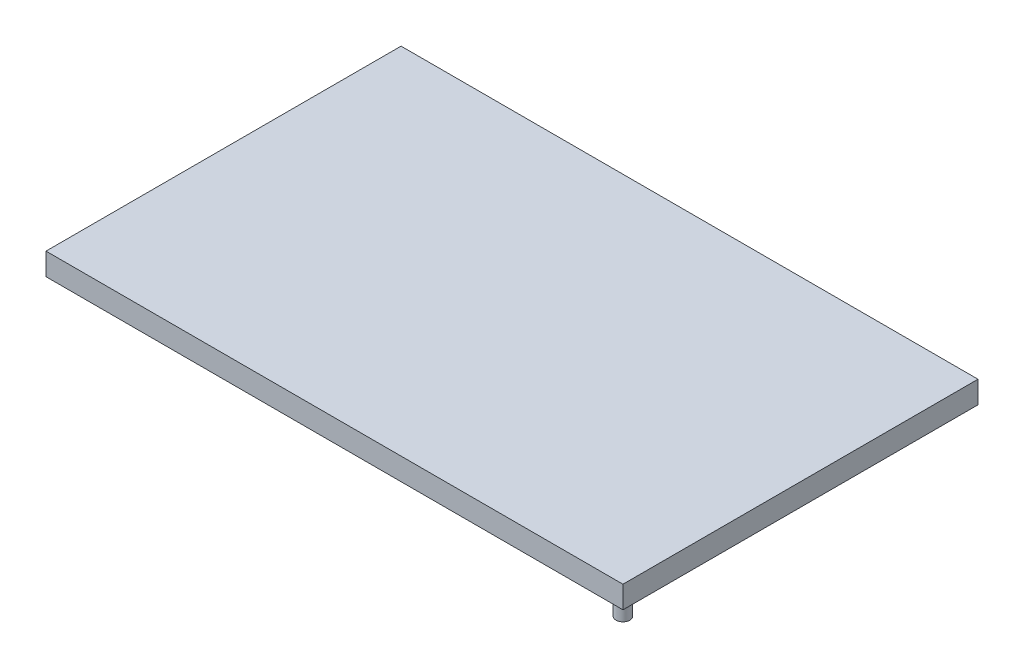
ISO-10303-21;
HEADER;
FILE_DESCRIPTION(('STEP AP214'),'2;1');
FILE_NAME('part.step','',(''),(''),'','','');
FILE_SCHEMA(('AUTOMOTIVE_DESIGN { 1 0 10303 214 1 1 1 1 }'));
ENDSEC;
DATA;
#1=APPLICATION_CONTEXT('core data for automotive mechanical design processes');
#2=APPLICATION_PROTOCOL_DEFINITION('international standard','automotive_design',2000,#1);
#3=PRODUCT_CONTEXT('',#1,'mechanical');
#4=PRODUCT('Part','Part','',(#3));
#5=PRODUCT_RELATED_PRODUCT_CATEGORY('part','',(#4));
#6=PRODUCT_DEFINITION_FORMATION('','',#4);
#7=PRODUCT_DEFINITION_CONTEXT('part definition',#1,'design');
#8=PRODUCT_DEFINITION('design','',#6,#7);
#9=PRODUCT_DEFINITION_SHAPE('','',#8);
#10=(LENGTH_UNIT() NAMED_UNIT(*) SI_UNIT(.MILLI.,.METRE.));
#11=(NAMED_UNIT(*) PLANE_ANGLE_UNIT() SI_UNIT($,.RADIAN.));
#12=(NAMED_UNIT(*) SI_UNIT($,.STERADIAN.) SOLID_ANGLE_UNIT());
#13=UNCERTAINTY_MEASURE_WITH_UNIT(LENGTH_MEASURE(1.E-05),#10,'distance_accuracy_value','');
#14=(GEOMETRIC_REPRESENTATION_CONTEXT(3) GLOBAL_UNCERTAINTY_ASSIGNED_CONTEXT((#13)) GLOBAL_UNIT_ASSIGNED_CONTEXT((#10,
#11,#12)) REPRESENTATION_CONTEXT('',''));
#15=CARTESIAN_POINT('',(0.,0.,0.));
#16=DIRECTION('',(0.,0.,1.));
#17=DIRECTION('',(1.,0.,0.));
#18=AXIS2_PLACEMENT_3D('',#15,#16,#17);
#19=CARTESIAN_POINT('',(-104.,8.,-64.));
#20=DIRECTION('',(0.,0.,-1.));
#21=DIRECTION('',(-1.,0.,0.));
#22=AXIS2_PLACEMENT_3D('',#19,#20,#21);
#23=PLANE('',#22);
#24=DIRECTION('',(1.,0.,0.));
#25=VECTOR('',#24,1.);
#26=CARTESIAN_POINT('',(-104.,0.,-64.));
#27=LINE('',#26,#25);
#28=CARTESIAN_POINT('',(-104.,0.,-64.));
#29=VERTEX_POINT('',#28);
#30=CARTESIAN_POINT('',(104.,0.,-64.));
#31=VERTEX_POINT('',#30);
#32=EDGE_CURVE('E113',#29,#31,#27,.T.);
#33=ORIENTED_EDGE('',*,*,#32,.F.);
#34=DIRECTION('',(0.,-1.,0.));
#35=VECTOR('',#34,1.);
#36=CARTESIAN_POINT('',(-104.,8.,-64.));
#37=LINE('',#36,#35);
#38=CARTESIAN_POINT('',(-104.,8.,-64.));
#39=VERTEX_POINT('',#38);
#40=EDGE_CURVE('E56',#39,#29,#37,.T.);
#41=ORIENTED_EDGE('',*,*,#40,.F.);
#42=DIRECTION('',(1.,0.,0.));
#43=VECTOR('',#42,1.);
#44=CARTESIAN_POINT('',(-104.,8.,-64.));
#45=LINE('',#44,#43);
#46=CARTESIAN_POINT('',(104.,8.,-64.));
#47=VERTEX_POINT('',#46);
#48=EDGE_CURVE('E145',#39,#47,#45,.T.);
#49=ORIENTED_EDGE('',*,*,#48,.T.);
#50=DIRECTION('',(0.,-1.,0.));
#51=VECTOR('',#50,1.);
#52=CARTESIAN_POINT('',(104.,8.,-64.));
#53=LINE('',#52,#51);
#54=EDGE_CURVE('E81',#47,#31,#53,.T.);
#55=ORIENTED_EDGE('',*,*,#54,.T.);
#56=EDGE_LOOP('',(#33,#41,#49,#55));
#57=FACE_BOUND('',#56,.T.);
#58=ADVANCED_FACE('F33',(#57),#23,.T.);
#59=CARTESIAN_POINT('',(-104.,8.,-64.));
#60=DIRECTION('',(1.,0.,0.));
#61=DIRECTION('',(0.,0.,-1.));
#62=AXIS2_PLACEMENT_3D('',#59,#60,#61);
#63=PLANE('',#62);
#64=DIRECTION('',(0.,0.,1.));
#65=VECTOR('',#64,1.);
#66=CARTESIAN_POINT('',(-104.,0.,-64.));
#67=LINE('',#66,#65);
#68=CARTESIAN_POINT('',(-104.,0.,64.));
#69=VERTEX_POINT('',#68);
#70=EDGE_CURVE('E148',#29,#69,#67,.T.);
#71=ORIENTED_EDGE('',*,*,#70,.T.);
#72=DIRECTION('',(0.,-1.,0.));
#73=VECTOR('',#72,1.);
#74=CARTESIAN_POINT('',(-104.,8.,64.));
#75=LINE('',#74,#73);
#76=CARTESIAN_POINT('',(-104.,8.,64.));
#77=VERTEX_POINT('',#76);
#78=EDGE_CURVE('E164',#77,#69,#75,.T.);
#79=ORIENTED_EDGE('',*,*,#78,.F.);
#80=DIRECTION('',(0.,0.,1.));
#81=VECTOR('',#80,1.);
#82=CARTESIAN_POINT('',(-104.,8.,-64.));
#83=LINE('',#82,#81);
#84=EDGE_CURVE('E152',#39,#77,#83,.T.);
#85=ORIENTED_EDGE('',*,*,#84,.F.);
#86=ORIENTED_EDGE('',*,*,#40,.T.);
#87=EDGE_LOOP('',(#71,#79,#85,#86));
#88=FACE_BOUND('',#87,.T.);
#89=ADVANCED_FACE('F192',(#88),#63,.F.);
#90=CARTESIAN_POINT('',(-104.,8.,64.));
#91=DIRECTION('',(0.,0.,-1.));
#92=DIRECTION('',(-1.,0.,0.));
#93=AXIS2_PLACEMENT_3D('',#90,#91,#92);
#94=PLANE('',#93);
#95=DIRECTION('',(1.,0.,0.));
#96=VECTOR('',#95,1.);
#97=CARTESIAN_POINT('',(-104.,0.,64.));
#98=LINE('',#97,#96);
#99=CARTESIAN_POINT('',(104.,0.,64.));
#100=VERTEX_POINT('',#99);
#101=EDGE_CURVE('E159',#69,#100,#98,.T.);
#102=ORIENTED_EDGE('',*,*,#101,.T.);
#103=DIRECTION('',(0.,-1.,0.));
#104=VECTOR('',#103,1.);
#105=CARTESIAN_POINT('',(104.,8.,64.));
#106=LINE('',#105,#104);
#107=CARTESIAN_POINT('',(104.,8.,64.));
#108=VERTEX_POINT('',#107);
#109=EDGE_CURVE('E167',#108,#100,#106,.T.);
#110=ORIENTED_EDGE('',*,*,#109,.F.);
#111=DIRECTION('',(1.,0.,0.));
#112=VECTOR('',#111,1.);
#113=CARTESIAN_POINT('',(-104.,8.,64.));
#114=LINE('',#113,#112);
#115=EDGE_CURVE('E150',#77,#108,#114,.T.);
#116=ORIENTED_EDGE('',*,*,#115,.F.);
#117=ORIENTED_EDGE('',*,*,#78,.T.);
#118=EDGE_LOOP('',(#102,#110,#116,#117));
#119=FACE_BOUND('',#118,.T.);
#120=ADVANCED_FACE('F196',(#119),#94,.F.);
#121=CARTESIAN_POINT('',(104.,8.,-64.));
#122=DIRECTION('',(1.,0.,0.));
#123=DIRECTION('',(0.,0.,-1.));
#124=AXIS2_PLACEMENT_3D('',#121,#122,#123);
#125=PLANE('',#124);
#126=DIRECTION('',(0.,0.,1.));
#127=VECTOR('',#126,1.);
#128=CARTESIAN_POINT('',(104.,0.,-64.));
#129=LINE('',#128,#127);
#130=EDGE_CURVE('E156',#31,#100,#129,.T.);
#131=ORIENTED_EDGE('',*,*,#130,.F.);
#132=ORIENTED_EDGE('',*,*,#54,.F.);
#133=DIRECTION('',(0.,0.,1.));
#134=VECTOR('',#133,1.);
#135=CARTESIAN_POINT('',(104.,8.,-64.));
#136=LINE('',#135,#134);
#137=EDGE_CURVE('E147',#47,#108,#136,.T.);
#138=ORIENTED_EDGE('',*,*,#137,.T.);
#139=ORIENTED_EDGE('',*,*,#109,.T.);
#140=EDGE_LOOP('',(#131,#132,#138,#139));
#141=FACE_BOUND('',#140,.T.);
#142=ADVANCED_FACE('F208',(#141),#125,.T.);
#143=CARTESIAN_POINT('',(0.,8.,0.));
#144=DIRECTION('',(0.,-1.,0.));
#145=DIRECTION('',(0.,0.,-1.));
#146=AXIS2_PLACEMENT_3D('',#143,#144,#145);
#147=PLANE('',#146);
#148=ORIENTED_EDGE('',*,*,#48,.F.);
#149=ORIENTED_EDGE('',*,*,#84,.T.);
#150=ORIENTED_EDGE('',*,*,#115,.T.);
#151=ORIENTED_EDGE('',*,*,#137,.F.);
#152=EDGE_LOOP('',(#148,#149,#150,#151));
#153=FACE_BOUND('',#152,.T.);
#154=ADVANCED_FACE('F207',(#153),#147,.F.);
#155=CARTESIAN_POINT('',(0.,0.,0.));
#156=DIRECTION('',(0.,-1.,0.));
#157=DIRECTION('',(0.,0.,-1.));
#158=AXIS2_PLACEMENT_3D('',#155,#156,#157);
#159=PLANE('',#158);
#160=DIRECTION('',(0.,0.,1.));
#161=VECTOR('',#160,1.);
#162=CARTESIAN_POINT('',(100.,0.,0.));
#163=LINE('',#162,#161);
#164=CARTESIAN_POINT('',(100.,0.,-60.));
#165=VERTEX_POINT('',#164);
#166=CARTESIAN_POINT('',(100.,0.,60.));
#167=VERTEX_POINT('',#166);
#168=EDGE_CURVE('E47',#165,#167,#163,.T.);
#169=ORIENTED_EDGE('',*,*,#168,.F.);
#170=DIRECTION('',(1.,0.,0.));
#171=VECTOR('',#170,1.);
#172=CARTESIAN_POINT('',(0.,0.,-60.));
#173=LINE('',#172,#171);
#174=CARTESIAN_POINT('',(-100.,0.,-60.));
#175=VERTEX_POINT('',#174);
#176=EDGE_CURVE('E112',#175,#165,#173,.T.);
#177=ORIENTED_EDGE('',*,*,#176,.F.);
#178=DIRECTION('',(0.,0.,1.));
#179=VECTOR('',#178,1.);
#180=CARTESIAN_POINT('',(-100.,0.,0.));
#181=LINE('',#180,#179);
#182=CARTESIAN_POINT('',(-100.,0.,60.));
#183=VERTEX_POINT('',#182);
#184=EDGE_CURVE('E136',#175,#183,#181,.T.);
#185=ORIENTED_EDGE('',*,*,#184,.T.);
#186=DIRECTION('',(1.,0.,0.));
#187=VECTOR('',#186,1.);
#188=CARTESIAN_POINT('',(0.,0.,60.));
#189=LINE('',#188,#187);
#190=EDGE_CURVE('E122',#183,#167,#189,.T.);
#191=ORIENTED_EDGE('',*,*,#190,.T.);
#192=EDGE_LOOP('',(#169,#177,#185,#191));
#193=FACE_BOUND('',#192,.T.);
#194=ORIENTED_EDGE('',*,*,#32,.T.);
#195=ORIENTED_EDGE('',*,*,#130,.T.);
#196=ORIENTED_EDGE('',*,*,#101,.F.);
#197=ORIENTED_EDGE('',*,*,#70,.F.);
#198=EDGE_LOOP('',(#194,#195,#196,#197));
#199=FACE_BOUND('',#198,.T.);
#200=ADVANCED_FACE('F199',(#193,#199),#159,.T.);
#201=CARTESIAN_POINT('',(100.,4.,0.));
#202=DIRECTION('',(1.,0.,0.));
#203=DIRECTION('',(0.,0.,-1.));
#204=AXIS2_PLACEMENT_3D('',#201,#202,#203);
#205=PLANE('',#204);
#206=ORIENTED_EDGE('',*,*,#168,.T.);
#207=DIRECTION('',(0.,-1.,0.));
#208=VECTOR('',#207,1.);
#209=CARTESIAN_POINT('',(100.,4.,60.));
#210=LINE('',#209,#208);
#211=CARTESIAN_POINT('',(100.,4.,60.));
#212=VERTEX_POINT('',#211);
#213=EDGE_CURVE('E119',#212,#167,#210,.T.);
#214=ORIENTED_EDGE('',*,*,#213,.F.);
#215=DIRECTION('',(0.,0.,1.));
#216=VECTOR('',#215,1.);
#217=CARTESIAN_POINT('',(100.,4.,0.));
#218=LINE('',#217,#216);
#219=CARTESIAN_POINT('',(100.,4.,-60.));
#220=VERTEX_POINT('',#219);
#221=EDGE_CURVE('E117',#220,#212,#218,.T.);
#222=ORIENTED_EDGE('',*,*,#221,.F.);
#223=DIRECTION('',(0.,-1.,0.));
#224=VECTOR('',#223,1.);
#225=CARTESIAN_POINT('',(100.,4.,-60.));
#226=LINE('',#225,#224);
#227=EDGE_CURVE('E106',#220,#165,#226,.T.);
#228=ORIENTED_EDGE('',*,*,#227,.T.);
#229=EDGE_LOOP('',(#206,#214,#222,#228));
#230=FACE_BOUND('',#229,.T.);
#231=ADVANCED_FACE('F118',(#230),#205,.F.);
#232=CARTESIAN_POINT('',(0.,4.,-60.));
#233=DIRECTION('',(0.,0.,-1.));
#234=DIRECTION('',(-1.,0.,0.));
#235=AXIS2_PLACEMENT_3D('',#232,#233,#234);
#236=PLANE('',#235);
#237=ORIENTED_EDGE('',*,*,#176,.T.);
#238=ORIENTED_EDGE('',*,*,#227,.F.);
#239=DIRECTION('',(1.,0.,0.));
#240=VECTOR('',#239,1.);
#241=CARTESIAN_POINT('',(0.,4.,-60.));
#242=LINE('',#241,#240);
#243=CARTESIAN_POINT('',(-100.,4.,-60.));
#244=VERTEX_POINT('',#243);
#245=EDGE_CURVE('E110',#244,#220,#242,.T.);
#246=ORIENTED_EDGE('',*,*,#245,.F.);
#247=DIRECTION('',(0.,-1.,0.));
#248=VECTOR('',#247,1.);
#249=CARTESIAN_POINT('',(-100.,4.,-60.));
#250=LINE('',#249,#248);
#251=EDGE_CURVE('E114',#244,#175,#250,.T.);
#252=ORIENTED_EDGE('',*,*,#251,.T.);
#253=EDGE_LOOP('',(#237,#238,#246,#252));
#254=FACE_BOUND('',#253,.T.);
#255=ADVANCED_FACE('F108',(#254),#236,.F.);
#256=CARTESIAN_POINT('',(-100.,4.,0.));
#257=DIRECTION('',(1.,0.,0.));
#258=DIRECTION('',(0.,0.,-1.));
#259=AXIS2_PLACEMENT_3D('',#256,#257,#258);
#260=PLANE('',#259);
#261=ORIENTED_EDGE('',*,*,#184,.F.);
#262=ORIENTED_EDGE('',*,*,#251,.F.);
#263=DIRECTION('',(0.,0.,1.));
#264=VECTOR('',#263,1.);
#265=CARTESIAN_POINT('',(-100.,4.,0.));
#266=LINE('',#265,#264);
#267=CARTESIAN_POINT('',(-100.,4.,60.));
#268=VERTEX_POINT('',#267);
#269=EDGE_CURVE('E126',#244,#268,#266,.T.);
#270=ORIENTED_EDGE('',*,*,#269,.T.);
#271=DIRECTION('',(0.,-1.,0.));
#272=VECTOR('',#271,1.);
#273=CARTESIAN_POINT('',(-100.,4.,60.));
#274=LINE('',#273,#272);
#275=EDGE_CURVE('E142',#268,#183,#274,.T.);
#276=ORIENTED_EDGE('',*,*,#275,.T.);
#277=EDGE_LOOP('',(#261,#262,#270,#276));
#278=FACE_BOUND('',#277,.T.);
#279=ADVANCED_FACE('F187',(#278),#260,.T.);
#280=CARTESIAN_POINT('',(0.,4.,60.));
#281=DIRECTION('',(0.,0.,-1.));
#282=DIRECTION('',(-1.,0.,0.));
#283=AXIS2_PLACEMENT_3D('',#280,#281,#282);
#284=PLANE('',#283);
#285=ORIENTED_EDGE('',*,*,#190,.F.);
#286=ORIENTED_EDGE('',*,*,#275,.F.);
#287=DIRECTION('',(1.,0.,0.));
#288=VECTOR('',#287,1.);
#289=CARTESIAN_POINT('',(0.,4.,60.));
#290=LINE('',#289,#288);
#291=EDGE_CURVE('E128',#268,#212,#290,.T.);
#292=ORIENTED_EDGE('',*,*,#291,.T.);
#293=ORIENTED_EDGE('',*,*,#213,.T.);
#294=EDGE_LOOP('',(#285,#286,#292,#293));
#295=FACE_BOUND('',#294,.T.);
#296=ADVANCED_FACE('F175',(#295),#284,.T.);
#297=CARTESIAN_POINT('',(0.,4.,0.));
#298=DIRECTION('',(0.,1.,0.));
#299=DIRECTION('',(0.,0.,1.));
#300=AXIS2_PLACEMENT_3D('',#297,#298,#299);
#301=PLANE('',#300);
#302=CARTESIAN_POINT('',(90.,4.,50.));
#303=DIRECTION('',(0.,1.,0.));
#304=DIRECTION('',(0.,0.,1.));
#305=AXIS2_PLACEMENT_3D('',#302,#303,#304);
#306=CIRCLE('',#305,2.50000000000001);
#307=CARTESIAN_POINT('',(90.,4.,52.5));
#308=VERTEX_POINT('',#307);
#309=EDGE_CURVE('E11',#308,#308,#306,.F.);
#310=ORIENTED_EDGE('',*,*,#309,.F.);
#311=EDGE_LOOP('',(#310));
#312=FACE_BOUND('',#311,.T.);
#313=CARTESIAN_POINT('',(-90.,4.,-50.));
#314=DIRECTION('',(0.,1.,0.));
#315=DIRECTION('',(0.,0.,1.));
#316=AXIS2_PLACEMENT_3D('',#313,#314,#315);
#317=CIRCLE('',#316,2.50000000000001);
#318=CARTESIAN_POINT('',(-90.,4.,-47.5));
#319=VERTEX_POINT('',#318);
#320=EDGE_CURVE('E40',#319,#319,#317,.F.);
#321=ORIENTED_EDGE('',*,*,#320,.F.);
#322=EDGE_LOOP('',(#321));
#323=FACE_BOUND('',#322,.T.);
#324=ORIENTED_EDGE('',*,*,#221,.T.);
#325=ORIENTED_EDGE('',*,*,#291,.F.);
#326=ORIENTED_EDGE('',*,*,#269,.F.);
#327=ORIENTED_EDGE('',*,*,#245,.T.);
#328=EDGE_LOOP('',(#324,#325,#326,#327));
#329=FACE_BOUND('',#328,.T.);
#330=ADVANCED_FACE('F125',(#312,#323,#329),#301,.F.);
#331=CARTESIAN_POINT('',(-90.,-16.,-50.));
#332=DIRECTION('',(0.,1.,0.));
#333=DIRECTION('',(0.,0.,1.));
#334=AXIS2_PLACEMENT_3D('',#331,#332,#333);
#335=CYLINDRICAL_SURFACE('',#334,2.50000000000001);
#336=CARTESIAN_POINT('',(-90.,-16.,-50.));
#337=DIRECTION('',(0.,-1.,0.));
#338=DIRECTION('',(0.,0.,-1.));
#339=AXIS2_PLACEMENT_3D('',#336,#337,#338);
#340=CIRCLE('',#339,2.50000000000001);
#341=CARTESIAN_POINT('',(-90.,-16.,-52.5));
#342=VERTEX_POINT('',#341);
#343=EDGE_CURVE('E134',#342,#342,#340,.T.);
#344=ORIENTED_EDGE('',*,*,#343,.F.);
#345=EDGE_LOOP('',(#344));
#346=FACE_BOUND('',#345,.T.);
#347=ORIENTED_EDGE('',*,*,#320,.T.);
#348=EDGE_LOOP('',(#347));
#349=FACE_BOUND('',#348,.T.);
#350=ADVANCED_FACE('F172',(#346,#349),#335,.T.);
#351=CARTESIAN_POINT('',(-90.,-16.,-50.));
#352=DIRECTION('',(0.,-1.,0.));
#353=DIRECTION('',(0.,0.,-1.));
#354=AXIS2_PLACEMENT_3D('',#351,#352,#353);
#355=PLANE('',#354);
#356=ORIENTED_EDGE('',*,*,#343,.T.);
#357=EDGE_LOOP('',(#356));
#358=FACE_BOUND('',#357,.T.);
#359=ADVANCED_FACE('F183',(#358),#355,.T.);
#360=CARTESIAN_POINT('',(90.,-16.,50.));
#361=DIRECTION('',(0.,1.,0.));
#362=DIRECTION('',(0.,0.,1.));
#363=AXIS2_PLACEMENT_3D('',#360,#361,#362);
#364=CYLINDRICAL_SURFACE('',#363,2.50000000000001);
#365=CARTESIAN_POINT('',(90.,-16.,50.));
#366=DIRECTION('',(0.,-1.,0.));
#367=DIRECTION('',(0.,0.,-1.));
#368=AXIS2_PLACEMENT_3D('',#365,#366,#367);
#369=CIRCLE('',#368,2.50000000000001);
#370=CARTESIAN_POINT('',(90.,-16.,47.5));
#371=VERTEX_POINT('',#370);
#372=EDGE_CURVE('E278',#371,#371,#369,.T.);
#373=ORIENTED_EDGE('',*,*,#372,.F.);
#374=EDGE_LOOP('',(#373));
#375=FACE_BOUND('',#374,.T.);
#376=ORIENTED_EDGE('',*,*,#309,.T.);
#377=EDGE_LOOP('',(#376));
#378=FACE_BOUND('',#377,.T.);
#379=ADVANCED_FACE('F249',(#375,#378),#364,.T.);
#380=CARTESIAN_POINT('',(90.,-16.,50.));
#381=DIRECTION('',(0.,-1.,0.));
#382=DIRECTION('',(0.,0.,-1.));
#383=AXIS2_PLACEMENT_3D('',#380,#381,#382);
#384=PLANE('',#383);
#385=ORIENTED_EDGE('',*,*,#372,.T.);
#386=EDGE_LOOP('',(#385));
#387=FACE_BOUND('',#386,.T.);
#388=ADVANCED_FACE('F257',(#387),#384,.T.);
#389=CLOSED_SHELL('',(#58,#89,#120,#142,#154,#200,#231,#255,#279,#296,#330,#350,#359,#379,#388));
#390=MANIFOLD_SOLID_BREP('B2',#389);
#391=ADVANCED_BREP_SHAPE_REPRESENTATION('',(#18,#390),#14);
#392=SHAPE_DEFINITION_REPRESENTATION(#9,#391);
ENDSEC;
END-ISO-10303-21;
